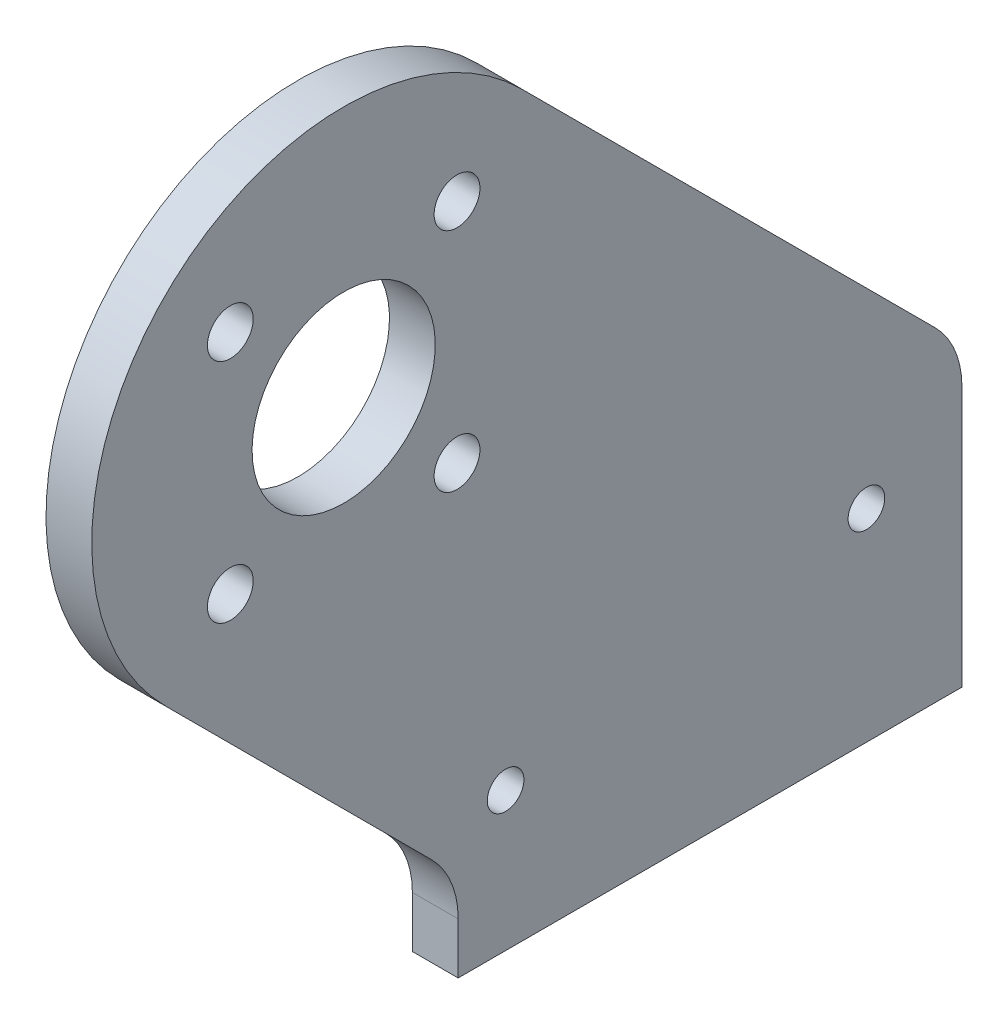
ISO-10303-21;
HEADER;
FILE_DESCRIPTION(('STEP AP214'),'2;1');
FILE_NAME('part.step','',(''),(''),'','','');
FILE_SCHEMA(('AUTOMOTIVE_DESIGN { 1 0 10303 214 1 1 1 1 }'));
ENDSEC;
DATA;
#1=APPLICATION_CONTEXT('core data for automotive mechanical design processes');
#2=APPLICATION_PROTOCOL_DEFINITION('international standard','automotive_design',2000,#1);
#3=PRODUCT_CONTEXT('',#1,'mechanical');
#4=PRODUCT('Part','Part','',(#3));
#5=PRODUCT_RELATED_PRODUCT_CATEGORY('part','',(#4));
#6=PRODUCT_DEFINITION_FORMATION('','',#4);
#7=PRODUCT_DEFINITION_CONTEXT('part definition',#1,'design');
#8=PRODUCT_DEFINITION('design','',#6,#7);
#9=PRODUCT_DEFINITION_SHAPE('','',#8);
#10=(LENGTH_UNIT() NAMED_UNIT(*) SI_UNIT(.MILLI.,.METRE.));
#11=(NAMED_UNIT(*) PLANE_ANGLE_UNIT() SI_UNIT($,.RADIAN.));
#12=(NAMED_UNIT(*) SI_UNIT($,.STERADIAN.) SOLID_ANGLE_UNIT());
#13=UNCERTAINTY_MEASURE_WITH_UNIT(LENGTH_MEASURE(1.E-05),#10,'distance_accuracy_value','');
#14=(GEOMETRIC_REPRESENTATION_CONTEXT(3) GLOBAL_UNCERTAINTY_ASSIGNED_CONTEXT((#13)) GLOBAL_UNIT_ASSIGNED_CONTEXT((#10,
#11,#12)) REPRESENTATION_CONTEXT('',''));
#15=CARTESIAN_POINT('',(0.,0.,0.));
#16=DIRECTION('',(0.,0.,1.));
#17=DIRECTION('',(1.,0.,0.));
#18=AXIS2_PLACEMENT_3D('',#15,#16,#17);
#19=CARTESIAN_POINT('',(61.61096680392,-28.0132034356,20.));
#20=DIRECTION('',(-1.,0.,0.));
#21=DIRECTION('',(0.,-0.707106781186548,0.707106781186548));
#22=AXIS2_PLACEMENT_3D('',#19,#20,#21);
#23=CYLINDRICAL_SURFACE('',#22,4.);
#24=CARTESIAN_POINT('',(59.5,-28.0132034356,20.));
#25=DIRECTION('',(1.,0.,0.));
#26=DIRECTION('',(0.,0.0533008588991099,-0.998578498887602));
#27=AXIS2_PLACEMENT_3D('',#24,#25,#26);
#28=CIRCLE('',#27,4.);
#29=CARTESIAN_POINT('',(59.5,-28.0132034356,16.));
#30=VERTEX_POINT('',#29);
#31=CARTESIAN_POINT('',(59.5,-25.18477631085,17.171572875254));
#32=VERTEX_POINT('',#31);
#33=EDGE_CURVE('E172',#30,#32,#28,.T.);
#34=ORIENTED_EDGE('',*,*,#33,.F.);
#35=DIRECTION('',(-1.,0.,0.));
#36=VECTOR('',#35,1.);
#37=CARTESIAN_POINT('',(61.54773426501,-28.0132034356,16.));
#38=LINE('',#37,#36);
#39=CARTESIAN_POINT('',(61.5,-28.0132034356,16.));
#40=VERTEX_POINT('',#39);
#41=EDGE_CURVE('E131',#40,#30,#38,.T.);
#42=ORIENTED_EDGE('',*,*,#41,.F.);
#43=CARTESIAN_POINT('',(61.5,-28.0132034356,20.));
#44=DIRECTION('',(-1.,0.,0.));
#45=DIRECTION('',(0.,0.707106781186548,-0.707106781186548));
#46=AXIS2_PLACEMENT_3D('',#43,#44,#45);
#47=CIRCLE('',#46,4.);
#48=CARTESIAN_POINT('',(61.5,-25.18477631085,17.171572875254));
#49=VERTEX_POINT('',#48);
#50=EDGE_CURVE('E46',#49,#40,#47,.T.);
#51=ORIENTED_EDGE('',*,*,#50,.F.);
#52=DIRECTION('',(-1.,0.,0.));
#53=VECTOR('',#52,1.);
#54=CARTESIAN_POINT('',(61.5,-25.18477631085,17.171572875254));
#55=LINE('',#54,#53);
#56=EDGE_CURVE('E158',#49,#32,#55,.T.);
#57=ORIENTED_EDGE('',*,*,#56,.T.);
#58=EDGE_LOOP('',(#34,#42,#51,#57));
#59=FACE_BOUND('',#58,.T.);
#60=ADVANCED_FACE('F37',(#59),#23,.F.);
#61=CARTESIAN_POINT('',(60.93933982822,-28.86066017178,-6.));
#62=DIRECTION('',(0.,0.,-1.));
#63=DIRECTION('',(1.,0.,0.));
#64=AXIS2_PLACEMENT_3D('',#61,#62,#63);
#65=PLANE('',#64);
#66=DIRECTION('',(1.,0.,0.));
#67=VECTOR('',#66,1.);
#68=CARTESIAN_POINT('',(59.5,-18.90050506339,-6.));
#69=LINE('',#68,#67);
#70=CARTESIAN_POINT('',(59.5,-18.90050506339,-6.));
#71=VERTEX_POINT('',#70);
#72=CARTESIAN_POINT('',(61.5,-18.90050506339,-6.));
#73=VERTEX_POINT('',#72);
#74=EDGE_CURVE('E170',#71,#73,#69,.T.);
#75=ORIENTED_EDGE('',*,*,#74,.T.);
#76=DIRECTION('',(0.,1.,0.));
#77=VECTOR('',#76,1.);
#78=CARTESIAN_POINT('',(61.5,-27.8,-6.));
#79=LINE('',#78,#77);
#80=CARTESIAN_POINT('',(61.5,-30.2494897427832,-6.));
#81=VERTEX_POINT('',#80);
#82=EDGE_CURVE('E101',#81,#73,#79,.T.);
#83=ORIENTED_EDGE('',*,*,#82,.F.);
#84=DIRECTION('',(-1.,0.,0.));
#85=VECTOR('',#84,1.);
#86=CARTESIAN_POINT('',(83.6415947150705,-30.2494897427832,-6.));
#87=LINE('',#86,#85);
#88=CARTESIAN_POINT('',(59.5,-30.2494897427832,-6.));
#89=VERTEX_POINT('',#88);
#90=EDGE_CURVE('E125',#81,#89,#87,.T.);
#91=ORIENTED_EDGE('',*,*,#90,.T.);
#92=DIRECTION('',(0.,1.,0.));
#93=VECTOR('',#92,1.);
#94=CARTESIAN_POINT('',(59.5,-27.8,-6.));
#95=LINE('',#94,#93);
#96=EDGE_CURVE('E139',#89,#71,#95,.T.);
#97=ORIENTED_EDGE('',*,*,#96,.T.);
#98=EDGE_LOOP('',(#75,#83,#91,#97));
#99=FACE_BOUND('',#98,.T.);
#100=ADVANCED_FACE('F222',(#99),#65,.T.);
#101=CARTESIAN_POINT('',(60.93933982822,-28.86066017178,16.));
#102=DIRECTION('',(0.,0.,1.));
#103=DIRECTION('',(0.,1.,0.));
#104=AXIS2_PLACEMENT_3D('',#101,#102,#103);
#105=PLANE('',#104);
#106=ORIENTED_EDGE('',*,*,#41,.T.);
#107=DIRECTION('',(0.,1.,0.));
#108=VECTOR('',#107,1.);
#109=CARTESIAN_POINT('',(59.5,-30.2494897427832,16.));
#110=LINE('',#109,#108);
#111=CARTESIAN_POINT('',(59.5,-30.2494897427832,16.));
#112=VERTEX_POINT('',#111);
#113=EDGE_CURVE('E128',#112,#30,#110,.T.);
#114=ORIENTED_EDGE('',*,*,#113,.F.);
#115=DIRECTION('',(-1.,0.,0.));
#116=VECTOR('',#115,1.);
#117=CARTESIAN_POINT('',(83.6415947150705,-30.2494897427832,16.));
#118=LINE('',#117,#116);
#119=CARTESIAN_POINT('',(61.5,-30.2494897427832,16.));
#120=VERTEX_POINT('',#119);
#121=EDGE_CURVE('E117',#120,#112,#118,.T.);
#122=ORIENTED_EDGE('',*,*,#121,.F.);
#123=DIRECTION('',(0.,1.,0.));
#124=VECTOR('',#123,1.);
#125=CARTESIAN_POINT('',(61.5,-28.86066017178,16.));
#126=LINE('',#125,#124);
#127=EDGE_CURVE('E104',#120,#40,#126,.T.);
#128=ORIENTED_EDGE('',*,*,#127,.T.);
#129=EDGE_LOOP('',(#106,#114,#122,#128));
#130=FACE_BOUND('',#129,.T.);
#131=ADVANCED_FACE('F129',(#130),#105,.T.);
#132=CARTESIAN_POINT('',(61.5,-27.8,32.));
#133=DIRECTION('',(1.,0.,0.));
#134=DIRECTION('',(0.,-1.,0.));
#135=AXIS2_PLACEMENT_3D('',#132,#133,#134);
#136=PLANE('',#135);
#137=CARTESIAN_POINT('',(61.5,-10.7497474683058,25.949747468306));
#138=DIRECTION('',(1.,0.,0.));
#139=DIRECTION('',(0.,0.,-1.));
#140=AXIS2_PLACEMENT_3D('',#137,#138,#139);
#141=CIRCLE('',#140,1.);
#142=CARTESIAN_POINT('',(61.5,-10.7497474683058,24.949747468306));
#143=VERTEX_POINT('',#142);
#144=EDGE_CURVE('E309',#143,#143,#141,.T.);
#145=ORIENTED_EDGE('',*,*,#144,.F.);
#146=EDGE_LOOP('',(#145));
#147=FACE_BOUND('',#146,.T.);
#148=CARTESIAN_POINT('',(61.5,-10.749747468306,16.0502525316943));
#149=DIRECTION('',(1.,0.,0.));
#150=DIRECTION('',(0.,0.,-1.));
#151=AXIS2_PLACEMENT_3D('',#148,#149,#150);
#152=CIRCLE('',#151,1.00000000000001);
#153=CARTESIAN_POINT('',(61.5,-10.749747468306,15.0502525316943));
#154=VERTEX_POINT('',#153);
#155=EDGE_CURVE('E317',#154,#154,#152,.T.);
#156=ORIENTED_EDGE('',*,*,#155,.F.);
#157=EDGE_LOOP('',(#156));
#158=FACE_BOUND('',#157,.T.);
#159=CARTESIAN_POINT('',(61.5,-0.850252531694309,16.0502525316942));
#160=DIRECTION('',(1.,0.,0.));
#161=DIRECTION('',(0.,0.,-1.));
#162=AXIS2_PLACEMENT_3D('',#159,#160,#161);
#163=CIRCLE('',#162,1.);
#164=CARTESIAN_POINT('',(61.5,-0.850252531694309,15.0502525316942));
#165=VERTEX_POINT('',#164);
#166=EDGE_CURVE('E313',#165,#165,#163,.T.);
#167=ORIENTED_EDGE('',*,*,#166,.F.);
#168=EDGE_LOOP('',(#167));
#169=FACE_BOUND('',#168,.T.);
#170=CARTESIAN_POINT('',(61.5,-0.850252531694147,25.9497474683058));
#171=DIRECTION('',(1.,0.,0.));
#172=DIRECTION('',(0.,0.,-1.));
#173=AXIS2_PLACEMENT_3D('',#170,#171,#172);
#174=CIRCLE('',#173,1.);
#175=CARTESIAN_POINT('',(61.5,-0.850252531694147,24.9497474683058));
#176=VERTEX_POINT('',#175);
#177=EDGE_CURVE('E140',#176,#176,#174,.T.);
#178=ORIENTED_EDGE('',*,*,#177,.F.);
#179=EDGE_LOOP('',(#178));
#180=FACE_BOUND('',#179,.T.);
#181=ORIENTED_EDGE('',*,*,#50,.T.);
#182=ORIENTED_EDGE('',*,*,#127,.F.);
#183=DIRECTION('',(0.,0.,1.));
#184=VECTOR('',#183,1.);
#185=CARTESIAN_POINT('',(61.5,-30.2494897427832,32.));
#186=LINE('',#185,#184);
#187=EDGE_CURVE('E123',#81,#120,#186,.T.);
#188=ORIENTED_EDGE('',*,*,#187,.F.);
#189=ORIENTED_EDGE('',*,*,#82,.T.);
#190=CARTESIAN_POINT('',(61.5,-18.90050506339,-2.));
#191=DIRECTION('',(1.,0.,0.));
#192=DIRECTION('',(0.,0.,-1.));
#193=AXIS2_PLACEMENT_3D('',#190,#191,#192);
#194=CIRCLE('',#193,4.);
#195=CARTESIAN_POINT('',(61.5,-16.07207793864,-4.82842712475));
#196=VERTEX_POINT('',#195);
#197=EDGE_CURVE('E161',#73,#196,#194,.T.);
#198=ORIENTED_EDGE('',*,*,#197,.T.);
#199=DIRECTION('',(0.,-0.707106781186548,-0.707106781186548));
#200=VECTOR('',#199,1.);
#201=CARTESIAN_POINT('',(61.5,1.97817459305205,13.221825406948));
#202=LINE('',#201,#200);
#203=CARTESIAN_POINT('',(61.5,1.97817459305205,13.221825406948));
#204=VERTEX_POINT('',#203);
#205=EDGE_CURVE('E149',#204,#196,#202,.T.);
#206=ORIENTED_EDGE('',*,*,#205,.F.);
#207=CARTESIAN_POINT('',(61.5,-5.79999999999998,21.));
#208=DIRECTION('',(-1.,0.,0.));
#209=DIRECTION('',(0.,0.745298433795883,-0.666731013663985));
#210=AXIS2_PLACEMENT_3D('',#207,#208,#209);
#211=CIRCLE('',#210,11.);
#212=CARTESIAN_POINT('',(61.5,-13.578174593052,28.778174593052));
#213=VERTEX_POINT('',#212);
#214=EDGE_CURVE('E62',#213,#204,#211,.T.);
#215=ORIENTED_EDGE('',*,*,#214,.F.);
#216=DIRECTION('',(0.,0.707106781186548,0.707106781186548));
#217=VECTOR('',#216,1.);
#218=CARTESIAN_POINT('',(61.5,-25.18477631085,17.171572875254));
#219=LINE('',#218,#217);
#220=EDGE_CURVE('E154',#49,#213,#219,.T.);
#221=ORIENTED_EDGE('',*,*,#220,.F.);
#222=EDGE_LOOP('',(#181,#182,#188,#189,#198,#206,#215,#221));
#223=FACE_BOUND('',#222,.T.);
#224=CARTESIAN_POINT('',(61.5,-24.18477631085,13.928932188135));
#225=DIRECTION('',(-1.,0.,0.));
#226=DIRECTION('',(0.,-1.,0.));
#227=AXIS2_PLACEMENT_3D('',#224,#225,#226);
#228=CIRCLE('',#227,0.8);
#229=CARTESIAN_POINT('',(61.5,-24.98477631085,13.928932188135));
#230=VERTEX_POINT('',#229);
#231=EDGE_CURVE('E164',#230,#230,#228,.T.);
#232=ORIENTED_EDGE('',*,*,#231,.T.);
#233=EDGE_LOOP('',(#232));
#234=FACE_BOUND('',#233,.T.);
#235=CARTESIAN_POINT('',(61.5,-21.40640546818,-1.82799186006));
#236=DIRECTION('',(-1.,0.,0.));
#237=DIRECTION('',(0.,-1.,0.));
#238=AXIS2_PLACEMENT_3D('',#235,#236,#237);
#239=CIRCLE('',#238,0.8);
#240=CARTESIAN_POINT('',(61.5,-22.20640546818,-1.82799186006));
#241=VERTEX_POINT('',#240);
#242=EDGE_CURVE('E167',#241,#241,#239,.T.);
#243=ORIENTED_EDGE('',*,*,#242,.T.);
#244=EDGE_LOOP('',(#243));
#245=FACE_BOUND('',#244,.T.);
#246=CARTESIAN_POINT('',(61.5,-5.79999999999995,21.));
#247=DIRECTION('',(-1.,0.,0.));
#248=DIRECTION('',(0.,0.707106842748795,-0.707106719624295));
#249=AXIS2_PLACEMENT_3D('',#246,#247,#248);
#250=CIRCLE('',#249,4.);
#251=CARTESIAN_POINT('',(61.5,-2.97157262900477,18.1715731215028));
#252=VERTEX_POINT('',#251);
#253=EDGE_CURVE('E11',#252,#252,#250,.T.);
#254=ORIENTED_EDGE('',*,*,#253,.T.);
#255=EDGE_LOOP('',(#254));
#256=FACE_BOUND('',#255,.T.);
#257=ADVANCED_FACE('F233',(#147,#158,#169,#180,#223,#234,#245,#256),#136,.T.);
#258=CARTESIAN_POINT('',(59.40518465266,-18.90050506339,-2.));
#259=DIRECTION('',(1.,0.,0.));
#260=DIRECTION('',(0.,0.,1.));
#261=AXIS2_PLACEMENT_3D('',#258,#259,#260);
#262=CYLINDRICAL_SURFACE('',#261,4.);
#263=ORIENTED_EDGE('',*,*,#74,.F.);
#264=CARTESIAN_POINT('',(59.5,-18.90050506339,-2.));
#265=DIRECTION('',(-1.,0.,0.));
#266=DIRECTION('',(0.,0.707106781186497,-0.707106781186598));
#267=AXIS2_PLACEMENT_3D('',#264,#265,#266);
#268=CIRCLE('',#267,4.);
#269=CARTESIAN_POINT('',(59.5,-16.07207793864,-4.82842712475));
#270=VERTEX_POINT('',#269);
#271=EDGE_CURVE('E173',#270,#71,#268,.T.);
#272=ORIENTED_EDGE('',*,*,#271,.F.);
#273=DIRECTION('',(1.,0.,0.));
#274=VECTOR('',#273,1.);
#275=CARTESIAN_POINT('',(59.5,-16.07207793864,-4.82842712475));
#276=LINE('',#275,#274);
#277=EDGE_CURVE('E151',#270,#196,#276,.T.);
#278=ORIENTED_EDGE('',*,*,#277,.T.);
#279=ORIENTED_EDGE('',*,*,#197,.F.);
#280=EDGE_LOOP('',(#263,#272,#278,#279));
#281=FACE_BOUND('',#280,.T.);
#282=ADVANCED_FACE('F237',(#281),#262,.T.);
#283=CARTESIAN_POINT('',(60.5,-7.63273811042195,3.61091270347));
#284=DIRECTION('',(0.,-0.707106781186548,0.707106781186548));
#285=DIRECTION('',(0.,0.707106781186548,0.707106781186548));
#286=AXIS2_PLACEMENT_3D('',#283,#284,#285);
#287=PLANE('',#286);
#288=DIRECTION('',(0.,-0.707106781186548,-0.707106781186548));
#289=VECTOR('',#288,1.);
#290=CARTESIAN_POINT('',(59.5,1.97817459305205,13.221825406948));
#291=LINE('',#290,#289);
#292=CARTESIAN_POINT('',(59.5,1.97817459305205,13.221825406948));
#293=VERTEX_POINT('',#292);
#294=EDGE_CURVE('E175',#293,#270,#291,.T.);
#295=ORIENTED_EDGE('',*,*,#294,.F.);
#296=DIRECTION('',(-1.,0.,0.));
#297=VECTOR('',#296,1.);
#298=CARTESIAN_POINT('',(61.5,1.97817459305205,13.221825406948));
#299=LINE('',#298,#297);
#300=EDGE_CURVE('E152',#204,#293,#299,.T.);
#301=ORIENTED_EDGE('',*,*,#300,.F.);
#302=ORIENTED_EDGE('',*,*,#205,.T.);
#303=ORIENTED_EDGE('',*,*,#277,.F.);
#304=EDGE_LOOP('',(#295,#301,#302,#303));
#305=FACE_BOUND('',#304,.T.);
#306=ADVANCED_FACE('F244',(#305),#287,.F.);
#307=CARTESIAN_POINT('',(60.5,-5.79999999999998,21.));
#308=DIRECTION('',(-1.,0.,0.));
#309=DIRECTION('',(0.,0.,-1.));
#310=AXIS2_PLACEMENT_3D('',#307,#308,#309);
#311=CYLINDRICAL_SURFACE('',#310,11.);
#312=ORIENTED_EDGE('',*,*,#214,.T.);
#313=ORIENTED_EDGE('',*,*,#300,.T.);
#314=CARTESIAN_POINT('',(59.5,-5.79999999999998,21.));
#315=DIRECTION('',(-1.,0.,0.));
#316=DIRECTION('',(0.,0.745298433795883,-0.666731013663985));
#317=AXIS2_PLACEMENT_3D('',#314,#315,#316);
#318=CIRCLE('',#317,11.);
#319=CARTESIAN_POINT('',(59.5,-13.578174593052,28.778174593052));
#320=VERTEX_POINT('',#319);
#321=EDGE_CURVE('E180',#320,#293,#318,.T.);
#322=ORIENTED_EDGE('',*,*,#321,.F.);
#323=DIRECTION('',(-1.,0.,0.));
#324=VECTOR('',#323,1.);
#325=CARTESIAN_POINT('',(61.5,-13.578174593052,28.778174593052));
#326=LINE('',#325,#324);
#327=EDGE_CURVE('E157',#213,#320,#326,.T.);
#328=ORIENTED_EDGE('',*,*,#327,.F.);
#329=EDGE_LOOP('',(#312,#313,#322,#328));
#330=FACE_BOUND('',#329,.T.);
#331=ADVANCED_FACE('F254',(#330),#311,.T.);
#332=CARTESIAN_POINT('',(60.5,-5.79999999999995,21.));
#333=DIRECTION('',(-1.,0.,0.));
#334=DIRECTION('',(0.,0.,-1.));
#335=AXIS2_PLACEMENT_3D('',#332,#333,#334);
#336=CYLINDRICAL_SURFACE('',#335,4.);
#337=CARTESIAN_POINT('',(59.5,-5.79999999999995,21.));
#338=DIRECTION('',(-1.,0.,0.));
#339=DIRECTION('',(0.,0.707106842748795,-0.707106719624295));
#340=AXIS2_PLACEMENT_3D('',#337,#338,#339);
#341=CIRCLE('',#340,4.);
#342=CARTESIAN_POINT('',(59.5,-2.97157262900477,18.1715731215028));
#343=VERTEX_POINT('',#342);
#344=EDGE_CURVE('E182',#343,#343,#341,.T.);
#345=ORIENTED_EDGE('',*,*,#344,.T.);
#346=EDGE_LOOP('',(#345));
#347=FACE_BOUND('',#346,.T.);
#348=ORIENTED_EDGE('',*,*,#253,.F.);
#349=EDGE_LOOP('',(#348));
#350=FACE_BOUND('',#349,.T.);
#351=ADVANCED_FACE('F256',(#347,#350),#336,.F.);
#352=CARTESIAN_POINT('',(60.5,-19.96726188958,22.389087296526));
#353=DIRECTION('',(0.,0.707106781186548,-0.707106781186548));
#354=DIRECTION('',(0.,-0.707106781186548,-0.707106781186548));
#355=AXIS2_PLACEMENT_3D('',#352,#353,#354);
#356=PLANE('',#355);
#357=ORIENTED_EDGE('',*,*,#327,.T.);
#358=DIRECTION('',(0.,0.707106781186548,0.707106781186548));
#359=VECTOR('',#358,1.);
#360=CARTESIAN_POINT('',(59.5,-25.18477631085,17.171572875254));
#361=LINE('',#360,#359);
#362=EDGE_CURVE('E94',#32,#320,#361,.T.);
#363=ORIENTED_EDGE('',*,*,#362,.F.);
#364=ORIENTED_EDGE('',*,*,#56,.F.);
#365=ORIENTED_EDGE('',*,*,#220,.T.);
#366=EDGE_LOOP('',(#357,#363,#364,#365));
#367=FACE_BOUND('',#366,.T.);
#368=ADVANCED_FACE('F217',(#367),#356,.F.);
#369=CARTESIAN_POINT('',(59.5,-27.8,32.));
#370=DIRECTION('',(1.,0.,0.));
#371=DIRECTION('',(0.,-1.,0.));
#372=AXIS2_PLACEMENT_3D('',#369,#370,#371);
#373=PLANE('',#372);
#374=CARTESIAN_POINT('',(59.5,-10.7497474683058,25.949747468306));
#375=DIRECTION('',(-1.,0.,0.));
#376=DIRECTION('',(0.,0.,1.));
#377=AXIS2_PLACEMENT_3D('',#374,#375,#376);
#378=CIRCLE('',#377,1.);
#379=CARTESIAN_POINT('',(59.5,-10.7497474683058,26.949747468306));
#380=VERTEX_POINT('',#379);
#381=EDGE_CURVE('E312',#380,#380,#378,.T.);
#382=ORIENTED_EDGE('',*,*,#381,.F.);
#383=EDGE_LOOP('',(#382));
#384=FACE_BOUND('',#383,.T.);
#385=CARTESIAN_POINT('',(59.5,-10.749747468306,16.0502525316943));
#386=DIRECTION('',(-1.,0.,0.));
#387=DIRECTION('',(0.,0.,1.));
#388=AXIS2_PLACEMENT_3D('',#385,#386,#387);
#389=CIRCLE('',#388,1.00000000000001);
#390=CARTESIAN_POINT('',(59.5,-10.749747468306,17.0502525316943));
#391=VERTEX_POINT('',#390);
#392=EDGE_CURVE('E314',#391,#391,#389,.T.);
#393=ORIENTED_EDGE('',*,*,#392,.F.);
#394=EDGE_LOOP('',(#393));
#395=FACE_BOUND('',#394,.T.);
#396=CARTESIAN_POINT('',(59.5,-0.850252531694309,16.0502525316942));
#397=DIRECTION('',(-1.,0.,0.));
#398=DIRECTION('',(0.,0.,1.));
#399=AXIS2_PLACEMENT_3D('',#396,#397,#398);
#400=CIRCLE('',#399,1.);
#401=CARTESIAN_POINT('',(59.5,-0.850252531694309,17.0502525316942));
#402=VERTEX_POINT('',#401);
#403=EDGE_CURVE('E320',#402,#402,#400,.T.);
#404=ORIENTED_EDGE('',*,*,#403,.F.);
#405=EDGE_LOOP('',(#404));
#406=FACE_BOUND('',#405,.T.);
#407=CARTESIAN_POINT('',(59.5,-0.850252531694147,25.9497474683058));
#408=DIRECTION('',(-1.,0.,0.));
#409=DIRECTION('',(0.,0.,1.));
#410=AXIS2_PLACEMENT_3D('',#407,#408,#409);
#411=CIRCLE('',#410,1.);
#412=CARTESIAN_POINT('',(59.5,-0.850252531694147,26.9497474683058));
#413=VERTEX_POINT('',#412);
#414=EDGE_CURVE('E143',#413,#413,#411,.T.);
#415=ORIENTED_EDGE('',*,*,#414,.F.);
#416=EDGE_LOOP('',(#415));
#417=FACE_BOUND('',#416,.T.);
#418=ORIENTED_EDGE('',*,*,#362,.T.);
#419=ORIENTED_EDGE('',*,*,#321,.T.);
#420=ORIENTED_EDGE('',*,*,#294,.T.);
#421=ORIENTED_EDGE('',*,*,#271,.T.);
#422=ORIENTED_EDGE('',*,*,#96,.F.);
#423=DIRECTION('',(0.,0.,1.));
#424=VECTOR('',#423,1.);
#425=CARTESIAN_POINT('',(59.5,-30.2494897427832,-6.));
#426=LINE('',#425,#424);
#427=EDGE_CURVE('E122',#89,#112,#426,.T.);
#428=ORIENTED_EDGE('',*,*,#427,.T.);
#429=ORIENTED_EDGE('',*,*,#113,.T.);
#430=ORIENTED_EDGE('',*,*,#33,.T.);
#431=EDGE_LOOP('',(#418,#419,#420,#421,#422,#428,#429,#430));
#432=FACE_BOUND('',#431,.T.);
#433=ORIENTED_EDGE('',*,*,#344,.F.);
#434=EDGE_LOOP('',(#433));
#435=FACE_BOUND('',#434,.T.);
#436=CARTESIAN_POINT('',(59.5,-24.18477631085,13.928932188135));
#437=DIRECTION('',(-1.,0.,0.));
#438=DIRECTION('',(0.,-1.,0.));
#439=AXIS2_PLACEMENT_3D('',#436,#437,#438);
#440=CIRCLE('',#439,1.1);
#441=CARTESIAN_POINT('',(59.5,-25.28477631085,13.928932188135));
#442=VERTEX_POINT('',#441);
#443=EDGE_CURVE('E192',#442,#442,#440,.T.);
#444=ORIENTED_EDGE('',*,*,#443,.F.);
#445=EDGE_LOOP('',(#444));
#446=FACE_BOUND('',#445,.T.);
#447=CARTESIAN_POINT('',(59.5,-21.40640546818,-1.82799186006));
#448=DIRECTION('',(-1.,0.,0.));
#449=DIRECTION('',(0.,-1.,0.));
#450=AXIS2_PLACEMENT_3D('',#447,#448,#449);
#451=CIRCLE('',#450,1.1);
#452=CARTESIAN_POINT('',(59.5,-22.50640546818,-1.82799186006));
#453=VERTEX_POINT('',#452);
#454=EDGE_CURVE('E197',#453,#453,#451,.T.);
#455=ORIENTED_EDGE('',*,*,#454,.F.);
#456=EDGE_LOOP('',(#455));
#457=FACE_BOUND('',#456,.T.);
#458=ADVANCED_FACE('F136',(#384,#395,#406,#417,#432,#435,#446,#457),#373,.F.);
#459=CARTESIAN_POINT('',(59.65,-24.18477631085,13.928932188135));
#460=DIRECTION('',(-1.,0.,0.));
#461=DIRECTION('',(0.,-1.,0.));
#462=AXIS2_PLACEMENT_3D('',#459,#460,#461);
#463=CONICAL_SURFACE('',#462,0.95,0.7853981625);
#464=ORIENTED_EDGE('',*,*,#443,.T.);
#465=EDGE_LOOP('',(#464));
#466=FACE_BOUND('',#465,.T.);
#467=CARTESIAN_POINT('',(59.8,-24.18477631085,13.928932188135));
#468=DIRECTION('',(-1.,0.,0.));
#469=DIRECTION('',(0.,1.,0.));
#470=AXIS2_PLACEMENT_3D('',#467,#468,#469);
#471=CIRCLE('',#470,0.8);
#472=CARTESIAN_POINT('',(59.8,-23.38477631085,13.928932188135));
#473=VERTEX_POINT('',#472);
#474=EDGE_CURVE('E196',#473,#473,#471,.T.);
#475=ORIENTED_EDGE('',*,*,#474,.F.);
#476=EDGE_LOOP('',(#475));
#477=FACE_BOUND('',#476,.T.);
#478=ADVANCED_FACE('F205',(#466,#477),#463,.F.);
#479=CARTESIAN_POINT('',(62.10472291998,-24.18477631085,13.928932188135));
#480=DIRECTION('',(-1.,0.,0.));
#481=DIRECTION('',(0.,-1.,0.));
#482=AXIS2_PLACEMENT_3D('',#479,#480,#481);
#483=CYLINDRICAL_SURFACE('',#482,0.8);
#484=ORIENTED_EDGE('',*,*,#474,.T.);
#485=EDGE_LOOP('',(#484));
#486=FACE_BOUND('',#485,.T.);
#487=ORIENTED_EDGE('',*,*,#231,.F.);
#488=EDGE_LOOP('',(#487));
#489=FACE_BOUND('',#488,.T.);
#490=ADVANCED_FACE('F202',(#486,#489),#483,.F.);
#491=CARTESIAN_POINT('',(59.65,-21.40640546818,-1.82799186006));
#492=DIRECTION('',(-1.,0.,0.));
#493=DIRECTION('',(0.,-1.,0.));
#494=AXIS2_PLACEMENT_3D('',#491,#492,#493);
#495=CONICAL_SURFACE('',#494,0.95,0.7853981625);
#496=ORIENTED_EDGE('',*,*,#454,.T.);
#497=EDGE_LOOP('',(#496));
#498=FACE_BOUND('',#497,.T.);
#499=CARTESIAN_POINT('',(59.8,-21.40640546818,-1.82799186006));
#500=DIRECTION('',(-1.,0.,0.));
#501=DIRECTION('',(0.,1.,0.));
#502=AXIS2_PLACEMENT_3D('',#499,#500,#501);
#503=CIRCLE('',#502,0.8);
#504=CARTESIAN_POINT('',(59.8,-20.60640546818,-1.82799186006));
#505=VERTEX_POINT('',#504);
#506=EDGE_CURVE('E41',#505,#505,#503,.T.);
#507=ORIENTED_EDGE('',*,*,#506,.F.);
#508=EDGE_LOOP('',(#507));
#509=FACE_BOUND('',#508,.T.);
#510=ADVANCED_FACE('F214',(#498,#509),#495,.F.);
#511=CARTESIAN_POINT('',(62.10472291998,-21.40640546818,-1.82799186006));
#512=DIRECTION('',(-1.,0.,0.));
#513=DIRECTION('',(0.,-1.,0.));
#514=AXIS2_PLACEMENT_3D('',#511,#512,#513);
#515=CYLINDRICAL_SURFACE('',#514,0.8);
#516=ORIENTED_EDGE('',*,*,#506,.T.);
#517=EDGE_LOOP('',(#516));
#518=FACE_BOUND('',#517,.T.);
#519=ORIENTED_EDGE('',*,*,#242,.F.);
#520=EDGE_LOOP('',(#519));
#521=FACE_BOUND('',#520,.T.);
#522=ADVANCED_FACE('F39',(#518,#521),#515,.F.);
#523=CARTESIAN_POINT('',(83.6415947150705,-30.2494897427832,-6.));
#524=DIRECTION('',(0.,-1.,0.));
#525=DIRECTION('',(0.,0.,-1.));
#526=AXIS2_PLACEMENT_3D('',#523,#524,#525);
#527=PLANE('',#526);
#528=ORIENTED_EDGE('',*,*,#90,.F.);
#529=ORIENTED_EDGE('',*,*,#187,.T.);
#530=ORIENTED_EDGE('',*,*,#121,.T.);
#531=ORIENTED_EDGE('',*,*,#427,.F.);
#532=EDGE_LOOP('',(#528,#529,#530,#531));
#533=FACE_BOUND('',#532,.T.);
#534=ADVANCED_FACE('F120',(#533),#527,.T.);
#535=CARTESIAN_POINT('',(73.5,-0.850252531694147,25.9497474683058));
#536=DIRECTION('',(-1.,0.,0.));
#537=DIRECTION('',(0.,0.,1.));
#538=AXIS2_PLACEMENT_3D('',#535,#536,#537);
#539=CYLINDRICAL_SURFACE('',#538,1.);
#540=ORIENTED_EDGE('',*,*,#177,.T.);
#541=EDGE_LOOP('',(#540));
#542=FACE_BOUND('',#541,.T.);
#543=ORIENTED_EDGE('',*,*,#414,.T.);
#544=EDGE_LOOP('',(#543));
#545=FACE_BOUND('',#544,.T.);
#546=ADVANCED_FACE('F285',(#542,#545),#539,.F.);
#547=CARTESIAN_POINT('',(73.5,-0.850252531694309,16.0502525316942));
#548=DIRECTION('',(-1.,0.,0.));
#549=DIRECTION('',(0.,0.,1.));
#550=AXIS2_PLACEMENT_3D('',#547,#548,#549);
#551=CYLINDRICAL_SURFACE('',#550,1.);
#552=ORIENTED_EDGE('',*,*,#166,.T.);
#553=EDGE_LOOP('',(#552));
#554=FACE_BOUND('',#553,.T.);
#555=ORIENTED_EDGE('',*,*,#403,.T.);
#556=EDGE_LOOP('',(#555));
#557=FACE_BOUND('',#556,.T.);
#558=ADVANCED_FACE('F289',(#554,#557),#551,.F.);
#559=CARTESIAN_POINT('',(73.5,-10.749747468306,16.0502525316943));
#560=DIRECTION('',(-1.,0.,0.));
#561=DIRECTION('',(0.,0.,1.));
#562=AXIS2_PLACEMENT_3D('',#559,#560,#561);
#563=CYLINDRICAL_SURFACE('',#562,1.00000000000001);
#564=ORIENTED_EDGE('',*,*,#155,.T.);
#565=EDGE_LOOP('',(#564));
#566=FACE_BOUND('',#565,.T.);
#567=ORIENTED_EDGE('',*,*,#392,.T.);
#568=EDGE_LOOP('',(#567));
#569=FACE_BOUND('',#568,.T.);
#570=ADVANCED_FACE('F294',(#566,#569),#563,.F.);
#571=CARTESIAN_POINT('',(73.5,-10.7497474683058,25.949747468306));
#572=DIRECTION('',(-1.,0.,0.));
#573=DIRECTION('',(0.,0.,1.));
#574=AXIS2_PLACEMENT_3D('',#571,#572,#573);
#575=CYLINDRICAL_SURFACE('',#574,1.);
#576=ORIENTED_EDGE('',*,*,#144,.T.);
#577=EDGE_LOOP('',(#576));
#578=FACE_BOUND('',#577,.T.);
#579=ORIENTED_EDGE('',*,*,#381,.T.);
#580=EDGE_LOOP('',(#579));
#581=FACE_BOUND('',#580,.T.);
#582=ADVANCED_FACE('F301',(#578,#581),#575,.F.);
#583=CLOSED_SHELL('',(#60,#100,#131,#257,#282,#306,#331,#351,#368,#458,#478,#490,#510,#522,#534,
#546,#558,#570,#582));
#584=MANIFOLD_SOLID_BREP('B2',#583);
#585=ADVANCED_BREP_SHAPE_REPRESENTATION('',(#18,#584),#14);
#586=SHAPE_DEFINITION_REPRESENTATION(#9,#585);
ENDSEC;
END-ISO-10303-21;
